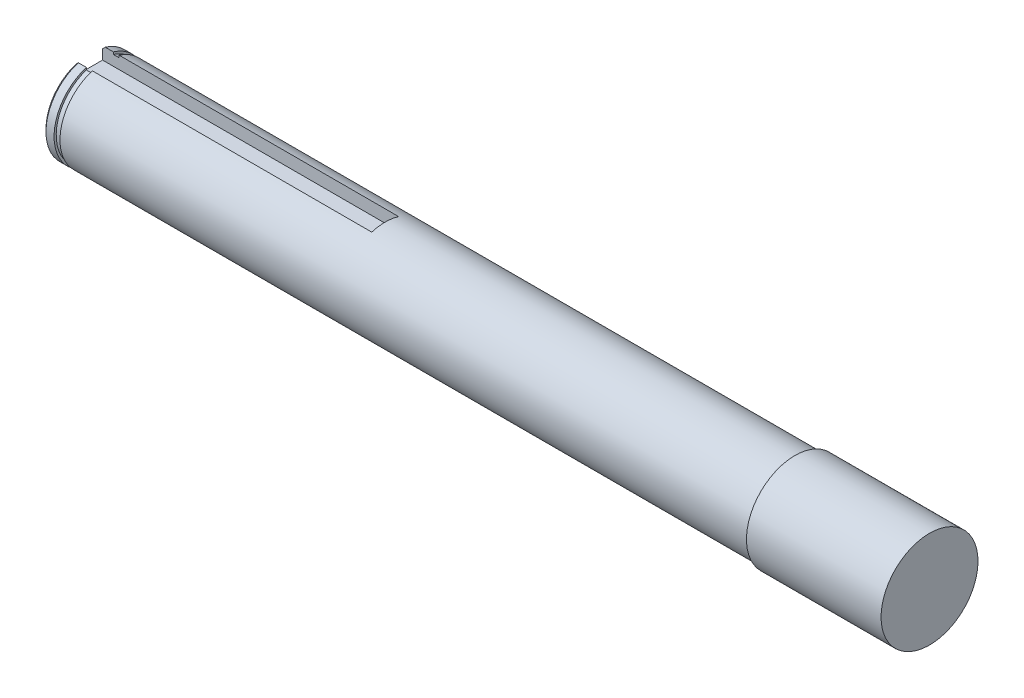
ISO-10303-21;
HEADER;
FILE_DESCRIPTION(('STEP AP214'),'2;1');
FILE_NAME('part.step','',(''),(''),'','','');
FILE_SCHEMA(('AUTOMOTIVE_DESIGN { 1 0 10303 214 1 1 1 1 }'));
ENDSEC;
DATA;
#1=APPLICATION_CONTEXT('core data for automotive mechanical design processes');
#2=APPLICATION_PROTOCOL_DEFINITION('international standard','automotive_design',2000,#1);
#3=PRODUCT_CONTEXT('',#1,'mechanical');
#4=PRODUCT('Part','Part','',(#3));
#5=PRODUCT_RELATED_PRODUCT_CATEGORY('part','',(#4));
#6=PRODUCT_DEFINITION_FORMATION('','',#4);
#7=PRODUCT_DEFINITION_CONTEXT('part definition',#1,'design');
#8=PRODUCT_DEFINITION('design','',#6,#7);
#9=PRODUCT_DEFINITION_SHAPE('','',#8);
#10=(LENGTH_UNIT() NAMED_UNIT(*) SI_UNIT(.MILLI.,.METRE.));
#11=(NAMED_UNIT(*) PLANE_ANGLE_UNIT() SI_UNIT($,.RADIAN.));
#12=(NAMED_UNIT(*) SI_UNIT($,.STERADIAN.) SOLID_ANGLE_UNIT());
#13=UNCERTAINTY_MEASURE_WITH_UNIT(LENGTH_MEASURE(1.E-05),#10,'distance_accuracy_value','');
#14=(GEOMETRIC_REPRESENTATION_CONTEXT(3) GLOBAL_UNCERTAINTY_ASSIGNED_CONTEXT((#13)) GLOBAL_UNIT_ASSIGNED_CONTEXT((#10,
#11,#12)) REPRESENTATION_CONTEXT('',''));
#15=CARTESIAN_POINT('',(0.,0.,0.));
#16=DIRECTION('',(0.,0.,1.));
#17=DIRECTION('',(1.,0.,0.));
#18=AXIS2_PLACEMENT_3D('',#15,#16,#17);
#19=CARTESIAN_POINT('',(0.,0.,0.));
#20=DIRECTION('',(1.,0.,0.));
#21=DIRECTION('',(0.,0.,1.));
#22=AXIS2_PLACEMENT_3D('',#19,#20,#21);
#23=PLANE('',#22);
#24=DIRECTION('',(0.,0.,-1.));
#25=VECTOR('',#24,1.);
#26=CARTESIAN_POINT('',(0.,5.8,2.5));
#27=LINE('',#26,#25);
#28=CARTESIAN_POINT('',(0.,5.8,2.5));
#29=VERTEX_POINT('',#28);
#30=CARTESIAN_POINT('',(0.,5.8,-2.5));
#31=VERTEX_POINT('',#30);
#32=EDGE_CURVE('E127',#29,#31,#27,.T.);
#33=ORIENTED_EDGE('',*,*,#32,.T.);
#34=DIRECTION('',(0.,1.,0.));
#35=VECTOR('',#34,1.);
#36=CARTESIAN_POINT('',(0.,5.8,-2.5));
#37=LINE('',#36,#35);
#38=CARTESIAN_POINT('',(0.,7.59934207678534,-2.5));
#39=VERTEX_POINT('',#38);
#40=EDGE_CURVE('E140',#31,#39,#37,.T.);
#41=ORIENTED_EDGE('',*,*,#40,.T.);
#42=CARTESIAN_POINT('',(0.,0.,0.));
#43=DIRECTION('',(-1.,0.,0.));
#44=DIRECTION('',(0.,0.,1.));
#45=AXIS2_PLACEMENT_3D('',#42,#43,#44);
#46=CIRCLE('',#45,8.);
#47=CARTESIAN_POINT('',(0.,7.59934207678534,2.5));
#48=VERTEX_POINT('',#47);
#49=EDGE_CURVE('E222',#48,#39,#46,.F.);
#50=ORIENTED_EDGE('',*,*,#49,.F.);
#51=DIRECTION('',(0.,-1.,0.));
#52=VECTOR('',#51,1.);
#53=CARTESIAN_POINT('',(0.,11.3,2.5));
#54=LINE('',#53,#52);
#55=EDGE_CURVE('E148',#48,#29,#54,.T.);
#56=ORIENTED_EDGE('',*,*,#55,.T.);
#57=EDGE_LOOP('',(#33,#41,#50,#56));
#58=FACE_BOUND('',#57,.T.);
#59=ADVANCED_FACE('F45',(#58),#23,.F.);
#60=CARTESIAN_POINT('',(0.,0.,0.));
#61=DIRECTION('',(-1.,0.,0.));
#62=DIRECTION('',(0.,0.,-1.));
#63=AXIS2_PLACEMENT_3D('',#60,#61,#62);
#64=CYLINDRICAL_SURFACE('',#63,8.5);
#65=CARTESIAN_POINT('',(0.5,0.,0.));
#66=DIRECTION('',(-1.,0.,0.));
#67=DIRECTION('',(0.,0.,1.));
#68=AXIS2_PLACEMENT_3D('',#65,#66,#67);
#69=CIRCLE('',#68,8.5);
#70=CARTESIAN_POINT('',(0.5,8.12403840463596,-2.5));
#71=VERTEX_POINT('',#70);
#72=CARTESIAN_POINT('',(0.5,8.12403840463596,2.5));
#73=VERTEX_POINT('',#72);
#74=EDGE_CURVE('E225',#71,#73,#69,.T.);
#75=ORIENTED_EDGE('',*,*,#74,.F.);
#76=DIRECTION('',(-1.,0.,0.));
#77=VECTOR('',#76,1.);
#78=CARTESIAN_POINT('',(0.,8.12403840463596,-2.5));
#79=LINE('',#78,#77);
#80=CARTESIAN_POINT('',(2.,8.12403840463596,-2.5));
#81=VERTEX_POINT('',#80);
#82=EDGE_CURVE('E157',#81,#71,#79,.T.);
#83=ORIENTED_EDGE('',*,*,#82,.F.);
#84=CARTESIAN_POINT('',(2.,0.,0.));
#85=DIRECTION('',(1.,0.,0.));
#86=DIRECTION('',(0.,0.,-1.));
#87=AXIS2_PLACEMENT_3D('',#84,#85,#86);
#88=CIRCLE('',#87,8.5);
#89=CARTESIAN_POINT('',(2.,8.12403840463596,2.5));
#90=VERTEX_POINT('',#89);
#91=EDGE_CURVE('E218',#90,#81,#88,.T.);
#92=ORIENTED_EDGE('',*,*,#91,.F.);
#93=DIRECTION('',(-1.,0.,0.));
#94=VECTOR('',#93,1.);
#95=CARTESIAN_POINT('',(0.,8.12403840463596,2.5));
#96=LINE('',#95,#94);
#97=EDGE_CURVE('E173',#73,#90,#96,.F.);
#98=ORIENTED_EDGE('',*,*,#97,.F.);
#99=EDGE_LOOP('',(#75,#83,#92,#98));
#100=FACE_BOUND('',#99,.T.);
#101=ADVANCED_FACE('F270',(#100),#64,.T.);
#102=CARTESIAN_POINT('',(2.,8.5,0.));
#103=DIRECTION('',(-1.,0.,0.));
#104=DIRECTION('',(0.,0.,-1.));
#105=AXIS2_PLACEMENT_3D('',#102,#103,#104);
#106=PLANE('',#105);
#107=ORIENTED_EDGE('',*,*,#91,.T.);
#108=DIRECTION('',(0.,1.,0.));
#109=VECTOR('',#108,1.);
#110=CARTESIAN_POINT('',(2.,8.5,-2.5));
#111=LINE('',#110,#109);
#112=CARTESIAN_POINT('',(2.,7.70454411370329,-2.5));
#113=VERTEX_POINT('',#112);
#114=EDGE_CURVE('E161',#113,#81,#111,.T.);
#115=ORIENTED_EDGE('',*,*,#114,.F.);
#116=CARTESIAN_POINT('',(2.,0.,0.));
#117=DIRECTION('',(1.,0.,0.));
#118=DIRECTION('',(0.,0.,-1.));
#119=AXIS2_PLACEMENT_3D('',#116,#117,#118);
#120=CIRCLE('',#119,8.1);
#121=CARTESIAN_POINT('',(2.,7.70454411370329,2.5));
#122=VERTEX_POINT('',#121);
#123=EDGE_CURVE('E214',#122,#113,#120,.T.);
#124=ORIENTED_EDGE('',*,*,#123,.F.);
#125=DIRECTION('',(0.,-1.,0.));
#126=VECTOR('',#125,1.);
#127=CARTESIAN_POINT('',(2.,8.5,2.5));
#128=LINE('',#127,#126);
#129=EDGE_CURVE('E177',#90,#122,#128,.T.);
#130=ORIENTED_EDGE('',*,*,#129,.F.);
#131=EDGE_LOOP('',(#107,#115,#124,#130));
#132=FACE_BOUND('',#131,.T.);
#133=ADVANCED_FACE('F266',(#132),#106,.F.);
#134=CARTESIAN_POINT('',(0.,0.,0.));
#135=DIRECTION('',(-1.,0.,0.));
#136=DIRECTION('',(0.,0.,-1.));
#137=AXIS2_PLACEMENT_3D('',#134,#135,#136);
#138=CYLINDRICAL_SURFACE('',#137,8.1);
#139=ORIENTED_EDGE('',*,*,#123,.T.);
#140=DIRECTION('',(-1.,0.,0.));
#141=VECTOR('',#140,1.);
#142=CARTESIAN_POINT('',(0.,7.70454411370329,-2.5));
#143=LINE('',#142,#141);
#144=CARTESIAN_POINT('',(3.1,7.70454411370329,-2.5));
#145=VERTEX_POINT('',#144);
#146=EDGE_CURVE('E164',#145,#113,#143,.T.);
#147=ORIENTED_EDGE('',*,*,#146,.F.);
#148=CARTESIAN_POINT('',(3.1,0.,0.));
#149=DIRECTION('',(1.,0.,0.));
#150=DIRECTION('',(0.,0.,-1.));
#151=AXIS2_PLACEMENT_3D('',#148,#149,#150);
#152=CIRCLE('',#151,8.1);
#153=CARTESIAN_POINT('',(3.1,7.70454411370329,2.5));
#154=VERTEX_POINT('',#153);
#155=EDGE_CURVE('E210',#154,#145,#152,.T.);
#156=ORIENTED_EDGE('',*,*,#155,.F.);
#157=DIRECTION('',(-1.,0.,0.));
#158=VECTOR('',#157,1.);
#159=CARTESIAN_POINT('',(0.,7.70454411370329,2.5));
#160=LINE('',#159,#158);
#161=EDGE_CURVE('E181',#122,#154,#160,.F.);
#162=ORIENTED_EDGE('',*,*,#161,.F.);
#163=EDGE_LOOP('',(#139,#147,#156,#162));
#164=FACE_BOUND('',#163,.T.);
#165=ADVANCED_FACE('F262',(#164),#138,.T.);
#166=CARTESIAN_POINT('',(3.1,8.1,0.));
#167=DIRECTION('',(1.,0.,0.));
#168=DIRECTION('',(0.,0.,1.));
#169=AXIS2_PLACEMENT_3D('',#166,#167,#168);
#170=PLANE('',#169);
#171=ORIENTED_EDGE('',*,*,#155,.T.);
#172=DIRECTION('',(0.,-1.,0.));
#173=VECTOR('',#172,1.);
#174=CARTESIAN_POINT('',(3.1,8.1,-2.5));
#175=LINE('',#174,#173);
#176=CARTESIAN_POINT('',(3.1,8.12403840463596,-2.5));
#177=VERTEX_POINT('',#176);
#178=EDGE_CURVE('E167',#177,#145,#175,.T.);
#179=ORIENTED_EDGE('',*,*,#178,.F.);
#180=CARTESIAN_POINT('',(3.1,0.,0.));
#181=DIRECTION('',(1.,0.,0.));
#182=DIRECTION('',(0.,0.,-1.));
#183=AXIS2_PLACEMENT_3D('',#180,#181,#182);
#184=CIRCLE('',#183,8.5);
#185=CARTESIAN_POINT('',(3.1,8.12403840463596,2.5));
#186=VERTEX_POINT('',#185);
#187=EDGE_CURVE('E207',#186,#177,#184,.T.);
#188=ORIENTED_EDGE('',*,*,#187,.F.);
#189=DIRECTION('',(0.,1.,0.));
#190=VECTOR('',#189,1.);
#191=CARTESIAN_POINT('',(3.1,8.1,2.5));
#192=LINE('',#191,#190);
#193=EDGE_CURVE('E185',#154,#186,#192,.T.);
#194=ORIENTED_EDGE('',*,*,#193,.F.);
#195=EDGE_LOOP('',(#171,#179,#188,#194));
#196=FACE_BOUND('',#195,.T.);
#197=ADVANCED_FACE('F259',(#196),#170,.F.);
#198=CARTESIAN_POINT('',(0.,0.,0.));
#199=DIRECTION('',(-1.,0.,0.));
#200=DIRECTION('',(0.,0.,-1.));
#201=AXIS2_PLACEMENT_3D('',#198,#199,#200);
#202=CYLINDRICAL_SURFACE('',#201,8.5);
#203=ORIENTED_EDGE('',*,*,#187,.T.);
#204=DIRECTION('',(-1.,0.,0.));
#205=VECTOR('',#204,1.);
#206=CARTESIAN_POINT('',(0.,8.12403840463596,-2.5));
#207=LINE('',#206,#205);
#208=CARTESIAN_POINT('',(55.,8.12403840463596,-2.5));
#209=VERTEX_POINT('',#208);
#210=EDGE_CURVE('E170',#209,#177,#207,.T.);
#211=ORIENTED_EDGE('',*,*,#210,.F.);
#212=CARTESIAN_POINT('',(55.,0.,0.));
#213=DIRECTION('',(1.,0.,0.));
#214=DIRECTION('',(0.,0.,-1.));
#215=AXIS2_PLACEMENT_3D('',#212,#213,#214);
#216=CIRCLE('',#215,8.5);
#217=CARTESIAN_POINT('',(55.,8.12403840463596,2.5));
#218=VERTEX_POINT('',#217);
#219=EDGE_CURVE('E11',#209,#218,#216,.T.);
#220=ORIENTED_EDGE('',*,*,#219,.T.);
#221=DIRECTION('',(-1.,0.,0.));
#222=VECTOR('',#221,1.);
#223=CARTESIAN_POINT('',(0.,8.12403840463596,2.5));
#224=LINE('',#223,#222);
#225=EDGE_CURVE('E69',#186,#218,#224,.F.);
#226=ORIENTED_EDGE('',*,*,#225,.F.);
#227=EDGE_LOOP('',(#203,#211,#220,#226));
#228=FACE_BOUND('',#227,.T.);
#229=CARTESIAN_POINT('',(131.1,0.,0.));
#230=DIRECTION('',(1.,0.,0.));
#231=DIRECTION('',(0.,0.,-1.));
#232=AXIS2_PLACEMENT_3D('',#229,#230,#231);
#233=CIRCLE('',#232,8.5);
#234=CARTESIAN_POINT('',(131.1,0.,-8.5));
#235=VERTEX_POINT('',#234);
#236=EDGE_CURVE('E203',#235,#235,#233,.T.);
#237=ORIENTED_EDGE('',*,*,#236,.F.);
#238=EDGE_LOOP('',(#237));
#239=FACE_BOUND('',#238,.T.);
#240=ADVANCED_FACE('F255',(#228,#239),#202,.T.);
#241=CARTESIAN_POINT('',(131.1,8.5,0.));
#242=DIRECTION('',(1.,0.,0.));
#243=DIRECTION('',(0.,0.,1.));
#244=AXIS2_PLACEMENT_3D('',#241,#242,#243);
#245=PLANE('',#244);
#246=ORIENTED_EDGE('',*,*,#236,.T.);
#247=EDGE_LOOP('',(#246));
#248=FACE_BOUND('',#247,.T.);
#249=CARTESIAN_POINT('',(131.1,0.,0.));
#250=DIRECTION('',(1.,0.,0.));
#251=DIRECTION('',(0.,0.,-1.));
#252=AXIS2_PLACEMENT_3D('',#249,#250,#251);
#253=CIRCLE('',#252,9.);
#254=CARTESIAN_POINT('',(131.1,0.,-9.));
#255=VERTEX_POINT('',#254);
#256=EDGE_CURVE('E199',#255,#255,#253,.T.);
#257=ORIENTED_EDGE('',*,*,#256,.F.);
#258=EDGE_LOOP('',(#257));
#259=FACE_BOUND('',#258,.T.);
#260=ADVANCED_FACE('F251',(#248,#259),#245,.F.);
#261=CARTESIAN_POINT('',(0.,0.,0.));
#262=DIRECTION('',(-1.,0.,0.));
#263=DIRECTION('',(0.,0.,-1.));
#264=AXIS2_PLACEMENT_3D('',#261,#262,#263);
#265=CYLINDRICAL_SURFACE('',#264,9.);
#266=CARTESIAN_POINT('',(143.1,-8.48528137423857,-3.));
#267=CARTESIAN_POINT('',(143.263404524508,-8.48528083591301,-3.00000077384314));
#268=CARTESIAN_POINT('',(143.426804399471,-8.49005307872571,-2.98660435105658));
#269=CARTESIAN_POINT('',(143.748763262983,-8.50852722243764,-2.93355339506643));
#270=CARTESIAN_POINT('',(143.907321449617,-8.52223059426567,-2.89389453650517));
#271=CARTESIAN_POINT('',(144.214880678992,-8.55684611066375,-2.78986645705471));
#272=CARTESIAN_POINT('',(144.363899788328,-8.57774411913965,-2.72554566420976));
#273=CARTESIAN_POINT('',(144.649080145644,-8.62437366030973,-2.57418488532417));
#274=CARTESIAN_POINT('',(144.785238547661,-8.65010625910836,-2.48713988658056));
#275=CARTESIAN_POINT('',(145.046159887015,-8.70463468222419,-2.28915343932864));
#276=CARTESIAN_POINT('',(145.170346286015,-8.73350684533931,-2.17747302413378));
#277=CARTESIAN_POINT('',(145.398620403674,-8.79041594403008,-1.9349630016432));
#278=CARTESIAN_POINT('',(145.502704894747,-8.81845274486885,-1.80413032515712));
#279=CARTESIAN_POINT('',(145.690436691989,-8.87141600765397,-1.52281352389504));
#280=CARTESIAN_POINT('',(145.773479911854,-8.89624223104816,-1.37190573367362));
#281=CARTESIAN_POINT('',(145.912774755383,-8.93908760312948,-1.05729366896247));
#282=CARTESIAN_POINT('',(145.969033599531,-8.95710858609005,-0.893592857061653));
#283=CARTESIAN_POINT('',(146.051207563897,-8.9837722629572,-0.564086452300485));
#284=CARTESIAN_POINT('',(146.078110338771,-8.99271944332677,-0.398552264558922));
#285=CARTESIAN_POINT('',(146.103948880082,-9.00130824654743,-0.0650936244722923));
#286=CARTESIAN_POINT('',(146.102891854957,-9.00095226788687,0.102830200631674));
#287=CARTESIAN_POINT('',(146.073467236302,-8.99118118856195,0.429310545581433));
#288=CARTESIAN_POINT('',(146.046172414577,-8.98212194265352,0.587976145774955));
#289=CARTESIAN_POINT('',(145.966821057059,-8.95640902019194,0.898330316466503));
#290=CARTESIAN_POINT('',(145.914762843061,-8.93975482893545,1.05001841333764));
#291=CARTESIAN_POINT('',(145.786736048082,-8.90027010879673,1.3444574245259));
#292=CARTESIAN_POINT('',(145.71046218436,-8.87736127572047,1.4870646629065));
#293=CARTESIAN_POINT('',(145.536420883654,-8.82775179116758,1.75777297658193));
#294=CARTESIAN_POINT('',(145.438647470017,-8.80105008604401,1.88587000315601));
#295=CARTESIAN_POINT('',(145.218976819621,-8.74518575549691,2.13030259965391));
#296=CARTESIAN_POINT('',(145.096160526476,-8.71596645506634,2.24580047119578));
#297=CARTESIAN_POINT('',(144.83265382282,-8.65942005746703,2.45483177879448));
#298=CARTESIAN_POINT('',(144.691960662816,-8.63209325236847,2.54836182984461));
#299=CARTESIAN_POINT('',(144.39403912319,-8.58211575363337,2.71196236510723));
#300=CARTESIAN_POINT('',(144.236603606047,-8.55953727854243,2.78167939086402));
#301=CARTESIAN_POINT('',(143.911285817357,-8.52244952473154,2.89332957980801));
#302=CARTESIAN_POINT('',(143.743407956381,-8.50793686461278,2.93527438724247));
#303=CARTESIAN_POINT('',(143.410084933765,-8.48938908946755,2.98848384629255));
#304=CARTESIAN_POINT('',(143.244871725754,-8.48491080956268,3.0010472865229));
#305=CARTESIAN_POINT('',(142.914671552658,-8.48570016177553,2.99881631672916));
#306=CARTESIAN_POINT('',(142.749684551928,-8.49096602375444,2.98402687568028));
#307=CARTESIAN_POINT('',(142.430529102864,-8.51020854270898,2.92867695465692));
#308=CARTESIAN_POINT('',(142.276183709548,-8.52387976322521,2.88901918194205));
#309=CARTESIAN_POINT('',(141.976369181282,-8.55805661013068,2.78614158768142));
#310=CARTESIAN_POINT('',(141.830901625228,-8.57856344804518,2.7229175890903));
#311=CARTESIAN_POINT('',(141.547858737459,-8.6249063278736,2.57242302221682));
#312=CARTESIAN_POINT('',(141.410680072075,-8.65089076996885,2.48445335507547));
#313=CARTESIAN_POINT('',(141.152561842849,-8.70497306192896,2.28775689167266));
#314=CARTESIAN_POINT('',(141.031627084016,-8.73307153331383,2.17902397649636));
#315=CARTESIAN_POINT('',(140.803416047728,-8.78985115913547,1.93767511770099));
#316=CARTESIAN_POINT('',(140.697076829943,-8.8184953073369,1.80416181163994));
#317=CARTESIAN_POINT('',(140.508251572956,-8.87180554839327,1.52048187420075));
#318=CARTESIAN_POINT('',(140.425764686513,-8.89647178253084,1.37031583459367));
#319=CARTESIAN_POINT('',(140.287739685415,-8.93893217431809,1.05833958729691));
#320=CARTESIAN_POINT('',(140.232026168556,-8.95677090013593,0.896613369963589));
#321=CARTESIAN_POINT('',(140.14881677382,-8.98375832513323,0.565375397538043));
#322=CARTESIAN_POINT('',(140.121310710358,-8.99291016102056,0.39586647586168));
#323=CARTESIAN_POINT('',(140.096213767183,-9.00125589708768,0.0624460075801456));
#324=CARTESIAN_POINT('',(140.097277638203,-9.00089760268317,-0.101354171760038));
#325=CARTESIAN_POINT('',(140.125971924439,-8.99136589558194,-0.426333435000508));
#326=CARTESIAN_POINT('',(140.153600184458,-8.98219319800727,-0.587512730457155));
#327=CARTESIAN_POINT('',(140.233746703728,-8.95622744863237,-0.900126358296175));
#328=CARTESIAN_POINT('',(140.285862646059,-8.93955775083445,-1.05167481273838));
#329=CARTESIAN_POINT('',(140.413132593292,-8.90031482113485,-1.34393505281939));
#330=CARTESIAN_POINT('',(140.488290765591,-8.8777405214405,-1.48464487242727));
#331=CARTESIAN_POINT('',(140.662708536306,-8.82797606483643,-1.75690204892633));
#332=CARTESIAN_POINT('',(140.762756056145,-8.80064617475779,-1.88791875467283));
#333=CARTESIAN_POINT('',(140.982772173469,-8.74478966375638,-2.1317430788173));
#334=CARTESIAN_POINT('',(141.102747126788,-8.71626266319292,-2.24454486487377));
#335=CARTESIAN_POINT('',(141.364828066761,-8.65989839476795,-2.45322542649934));
#336=CARTESIAN_POINT('',(141.50761653293,-8.63213183965892,-2.54826889799369));
#337=CARTESIAN_POINT('',(141.808003280708,-8.58180579969046,-2.71294302990334));
#338=CARTESIAN_POINT('',(141.965597679089,-8.55924495483748,-2.78258033045841));
#339=CARTESIAN_POINT('',(142.283885472047,-8.52304002619544,-2.89153148461249));
#340=CARTESIAN_POINT('',(142.444116790576,-8.50903898571547,-2.93207372744856));
#341=CARTESIAN_POINT('',(142.7695681514,-8.49016150618555,-2.9863029604478));
#342=CARTESIAN_POINT('',(142.934786452232,-8.48528191852383,-2.99999921758978));
#343=CARTESIAN_POINT('',(143.1,-8.48528137423857,-3.));
#344=B_SPLINE_CURVE_WITH_KNOTS('',3,(#266,#267,#268,#269,#270,#271,#272,#273,#274,#275,#276,
#277,#278,#279,#280,#281,#282,#283,#284,#285,#286,#287,#288,#289,#290,#291,#292,#293,#294,#295,
#296,#297,#298,#299,#300,#301,#302,#303,#304,#305,#306,#307,#308,#309,#310,#311,#312,#313,#314,
#315,#316,#317,#318,#319,#320,#321,#322,#323,#324,#325,#326,#327,#328,#329,#330,#331,#332,#333,
#334,#335,#336,#337,#338,#339,#340,#341,#342,#343),.UNSPECIFIED.,.T.,.F.,(4,2,2,2,2,2,2,2,2,2,2,
2,2,2,2,2,2,2,2,2,2,2,2,2,2,2,2,2,2,2,2,2,2,2,2,2,2,2,4),(0.,0.489601754398007,
0.979284165045345,1.46800988250241,1.95684349855632,2.46304012282701,2.96931795515958,
3.48880518430965,4.0081522916036,4.50942956294797,5.01057759906977,5.49207014476701,
5.97359532567702,6.46144964580997,6.94943975622058,7.46040523091744,7.97144938836311,
8.48977919529161,9.00789154069852,9.50262874093311,9.99727607511684,10.4749318730632,
10.9526723744084,11.4455657320715,11.9386045698638,12.4553642451328,12.972105562726,
13.4854137357255,13.9985364901247,14.4875425403291,14.9765089202934,15.4577086812129,
15.9389955228973,16.438065585619,16.9372951329789,17.4560670820843,17.974703348006,
18.4698963648807,18.9649184157139),.UNSPECIFIED.);
#345=CARTESIAN_POINT('',(143.1,-8.48528137423857,-3.));
#346=VERTEX_POINT('',#345);
#347=EDGE_CURVE('E194',#346,#346,#344,.T.);
#348=ORIENTED_EDGE('',*,*,#347,.F.);
#349=EDGE_LOOP('',(#348));
#350=FACE_BOUND('',#349,.T.);
#351=ORIENTED_EDGE('',*,*,#256,.T.);
#352=EDGE_LOOP('',(#351));
#353=FACE_BOUND('',#352,.T.);
#354=CARTESIAN_POINT('',(156.1,0.,0.));
#355=DIRECTION('',(1.,0.,0.));
#356=DIRECTION('',(0.,0.,-1.));
#357=AXIS2_PLACEMENT_3D('',#354,#355,#356);
#358=CIRCLE('',#357,9.);
#359=CARTESIAN_POINT('',(156.1,0.,-9.));
#360=VERTEX_POINT('',#359);
#361=EDGE_CURVE('E195',#360,#360,#358,.T.);
#362=ORIENTED_EDGE('',*,*,#361,.F.);
#363=EDGE_LOOP('',(#362));
#364=FACE_BOUND('',#363,.T.);
#365=ADVANCED_FACE('F246',(#350,#353,#364),#265,.T.);
#366=CARTESIAN_POINT('',(156.1,9.,0.));
#367=DIRECTION('',(-1.,0.,0.));
#368=DIRECTION('',(0.,0.,-1.));
#369=AXIS2_PLACEMENT_3D('',#366,#367,#368);
#370=PLANE('',#369);
#371=ORIENTED_EDGE('',*,*,#361,.T.);
#372=EDGE_LOOP('',(#371));
#373=FACE_BOUND('',#372,.T.);
#374=ADVANCED_FACE('F250',(#373),#370,.F.);
#375=CARTESIAN_POINT('',(0.,0.,0.));
#376=DIRECTION('',(1.,0.,0.));
#377=DIRECTION('',(0.,0.,1.));
#378=AXIS2_PLACEMENT_3D('',#375,#376,#377);
#379=CONICAL_SURFACE('',#378,8.,0.785398163397446);
#380=CARTESIAN_POINT('',(3.24610604354919,10.9647116306246,2.5));
#381=CARTESIAN_POINT('',(2.99226610631987,10.7043436729191,2.5));
#382=CARTESIAN_POINT('',(2.73864200216801,10.4437646712529,2.5));
#383=CARTESIAN_POINT('',(2.2319675749293,9.92205144385971,2.5));
#384=CARTESIAN_POINT('',(1.97891724967502,9.66091722023719,2.5));
#385=CARTESIAN_POINT('',(1.47356172830828,9.1379906840143,2.5));
#386=CARTESIAN_POINT('',(1.22125644417072,8.87619845652393,2.5));
#387=CARTESIAN_POINT('',(0.717566356513398,8.3517254890551,2.5));
#388=CARTESIAN_POINT('',(0.466181560123515,8.08904474222456,2.5));
#389=CARTESIAN_POINT('',(-0.0354029186888004,7.56248830616317,2.5));
#390=CARTESIAN_POINT('',(-0.285602442665667,7.29861246590988,2.5));
#391=CARTESIAN_POINT('',(-0.784347126830934,6.76930869771972,2.5));
#392=CARTESIAN_POINT('',(-1.0328923198316,6.50388080076392,2.5));
#393=CARTESIAN_POINT('',(-1.40397546236178,6.10409509913991,2.5));
#394=CARTESIAN_POINT('',(-1.52738902025476,5.97055013850755,2.5));
#395=CARTESIAN_POINT('',(-1.77350522053351,5.70280786524809,2.5));
#396=CARTESIAN_POINT('',(-1.89620786727091,5.56861055662342,2.5));
#397=CARTESIAN_POINT('',(-2.14075939416917,5.29942295024216,2.5));
#398=CARTESIAN_POINT('',(-2.26260821739897,5.16443260069008,2.5));
#399=CARTESIAN_POINT('',(-2.50522441386023,4.89347890214647,2.5));
#400=CARTESIAN_POINT('',(-2.62599176413088,4.75751553260641,2.5));
#401=CARTESIAN_POINT('',(-2.7461060435491,4.62097410787287,2.5));
#402=B_SPLINE_CURVE_WITH_KNOTS('',3,(#380,#381,#382,#383,#384,#385,#386,#387,#388,#389,#390,
#391,#392,#393,#394,#395,#396,#397,#398,#399,#400,#401),.UNSPECIFIED.,.F.,.F.,(4,2,2,2,2,2,2,2,
2,2,4),(0.,1.09088811407378,2.18177210044061,3.2725215843707,4.36327949919526,5.45417932798884,
6.54505745483649,7.0905702834248,7.63607976927667,8.18162528883418,8.72718236357148),.UNSPECIFIED.);
#403=EDGE_CURVE('E55',#73,#48,#402,.T.);
#404=ORIENTED_EDGE('',*,*,#403,.T.);
#405=ORIENTED_EDGE('',*,*,#49,.T.);
#406=CARTESIAN_POINT('',(-2.74610604354914,4.62097410787282,-2.5));
#407=CARTESIAN_POINT('',(-2.66135242444402,4.7173304968472,-2.5));
#408=CARTESIAN_POINT('',(-2.57626691146633,4.81339375304762,-2.5));
#409=CARTESIAN_POINT('',(-2.40552140151106,5.00500676740401,-2.5));
#410=CARTESIAN_POINT('',(-2.3198614103315,5.10055653072501,-2.5));
#411=CARTESIAN_POINT('',(-2.06215791358791,5.38654007082276,-2.5));
#412=CARTESIAN_POINT('',(-1.889384147226,5.57631573004792,-2.5));
#413=CARTESIAN_POINT('',(-1.54240055300874,5.95451406764861,-2.5));
#414=CARTESIAN_POINT('',(-1.36819086164736,6.14293687150735,-2.5));
#415=CARTESIAN_POINT('',(-1.01864950760585,6.51874212985348,-2.5));
#416=CARTESIAN_POINT('',(-0.843317831945389,6.70612457225783,-2.5));
#417=CARTESIAN_POINT('',(-0.316071063827654,7.26698950817808,-2.5));
#418=CARTESIAN_POINT('',(0.0371476941401721,7.63924588537825,-2.5));
#419=CARTESIAN_POINT('',(0.745830633262371,8.38162679915603,-2.5));
#420=CARTESIAN_POINT('',(1.1012948676923,8.75175128475163,-2.5));
#421=CARTESIAN_POINT('',(1.60612426497222,9.27519598982838,-2.5));
#422=CARTESIAN_POINT('',(1.75484886637541,9.42913459457362,-2.5));
#423=CARTESIAN_POINT('',(2.05253274789233,9.73678219574525,-2.5));
#424=CARTESIAN_POINT('',(2.20149202598042,9.89049119413146,-2.5));
#425=CARTESIAN_POINT('',(2.49962321546934,10.1977185877229,-2.5));
#426=CARTESIAN_POINT('',(2.64879513770283,10.3512369724139,-2.5));
#427=CARTESIAN_POINT('',(2.94732069775091,10.6580995039816,-2.5));
#428=CARTESIAN_POINT('',(3.09667433709522,10.8114436493703,-2.5));
#429=CARTESIAN_POINT('',(3.24610604354919,10.9647116306246,-2.5));
#430=B_SPLINE_CURVE_WITH_KNOTS('',3,(#406,#407,#408,#409,#410,#411,#412,#413,#414,#415,#416,
#417,#418,#419,#420,#421,#422,#423,#424,#425,#426,#427,#428,#429),.UNSPECIFIED.,.F.,.F.,(4,2,2,
2,2,2,2,2,2,2,2,4),(0.,0.384977817608326,0.769951755595784,1.53986909103482,2.30971406601729,
3.07956796356825,4.6190460584558,6.15856081679791,6.8007015083446,7.44283668718447,
8.08500583893924,8.72718043457028),.UNSPECIFIED.);
#431=EDGE_CURVE('E62',#39,#71,#430,.T.);
#432=ORIENTED_EDGE('',*,*,#431,.T.);
#433=ORIENTED_EDGE('',*,*,#74,.T.);
#434=EDGE_LOOP('',(#404,#405,#432,#433));
#435=FACE_BOUND('',#434,.T.);
#436=ADVANCED_FACE('F47',(#435),#379,.T.);
#437=CARTESIAN_POINT('',(143.1,-10.,0.));
#438=DIRECTION('',(0.,1.,0.));
#439=DIRECTION('',(0.,0.,-1.));
#440=AXIS2_PLACEMENT_3D('',#437,#438,#439);
#441=CYLINDRICAL_SURFACE('',#440,3.);
#442=CARTESIAN_POINT('',(143.1,-2.,0.));
#443=DIRECTION('',(0.,-1.,0.));
#444=DIRECTION('',(0.,0.,-1.));
#445=AXIS2_PLACEMENT_3D('',#442,#443,#444);
#446=CIRCLE('',#445,3.);
#447=CARTESIAN_POINT('',(143.1,-2.,-3.));
#448=VERTEX_POINT('',#447);
#449=EDGE_CURVE('E190',#448,#448,#446,.T.);
#450=ORIENTED_EDGE('',*,*,#449,.F.);
#451=EDGE_LOOP('',(#450));
#452=FACE_BOUND('',#451,.T.);
#453=ORIENTED_EDGE('',*,*,#347,.T.);
#454=EDGE_LOOP('',(#453));
#455=FACE_BOUND('',#454,.T.);
#456=ADVANCED_FACE('F242',(#452,#455),#441,.F.);
#457=CARTESIAN_POINT('',(143.1,-2.,0.));
#458=DIRECTION('',(0.,1.,0.));
#459=DIRECTION('',(0.,0.,-1.));
#460=AXIS2_PLACEMENT_3D('',#457,#458,#459);
#461=PLANE('',#460);
#462=ORIENTED_EDGE('',*,*,#449,.T.);
#463=EDGE_LOOP('',(#462));
#464=FACE_BOUND('',#463,.T.);
#465=ADVANCED_FACE('F309',(#464),#461,.F.);
#466=CARTESIAN_POINT('',(55.,0.,0.));
#467=DIRECTION('',(-1.,0.,0.));
#468=DIRECTION('',(0.,0.,-1.));
#469=AXIS2_PLACEMENT_3D('',#466,#467,#468);
#470=PLANE('',#469);
#471=ORIENTED_EDGE('',*,*,#219,.F.);
#472=DIRECTION('',(0.,1.,0.));
#473=VECTOR('',#472,1.);
#474=CARTESIAN_POINT('',(55.,5.8,-2.5));
#475=LINE('',#474,#473);
#476=CARTESIAN_POINT('',(55.,5.8,-2.5));
#477=VERTEX_POINT('',#476);
#478=EDGE_CURVE('E133',#477,#209,#475,.T.);
#479=ORIENTED_EDGE('',*,*,#478,.F.);
#480=DIRECTION('',(0.,0.,-1.));
#481=VECTOR('',#480,1.);
#482=CARTESIAN_POINT('',(55.,5.8,2.5));
#483=LINE('',#482,#481);
#484=CARTESIAN_POINT('',(55.,5.8,2.5));
#485=VERTEX_POINT('',#484);
#486=EDGE_CURVE('E124',#485,#477,#483,.T.);
#487=ORIENTED_EDGE('',*,*,#486,.F.);
#488=DIRECTION('',(0.,-1.,0.));
#489=VECTOR('',#488,1.);
#490=CARTESIAN_POINT('',(55.,11.3,2.5));
#491=LINE('',#490,#489);
#492=EDGE_CURVE('E135',#218,#485,#491,.T.);
#493=ORIENTED_EDGE('',*,*,#492,.F.);
#494=EDGE_LOOP('',(#471,#479,#487,#493));
#495=FACE_BOUND('',#494,.T.);
#496=ADVANCED_FACE('F142',(#495),#470,.T.);
#497=CARTESIAN_POINT('',(55.,11.3,2.5));
#498=DIRECTION('',(0.,0.,1.));
#499=DIRECTION('',(0.,1.,0.));
#500=AXIS2_PLACEMENT_3D('',#497,#498,#499);
#501=PLANE('',#500);
#502=ORIENTED_EDGE('',*,*,#193,.T.);
#503=ORIENTED_EDGE('',*,*,#225,.T.);
#504=ORIENTED_EDGE('',*,*,#492,.T.);
#505=DIRECTION('',(-1.,0.,0.));
#506=VECTOR('',#505,1.);
#507=CARTESIAN_POINT('',(55.,5.8,2.5));
#508=LINE('',#507,#506);
#509=EDGE_CURVE('E120',#485,#29,#508,.T.);
#510=ORIENTED_EDGE('',*,*,#509,.T.);
#511=ORIENTED_EDGE('',*,*,#55,.F.);
#512=ORIENTED_EDGE('',*,*,#403,.F.);
#513=ORIENTED_EDGE('',*,*,#97,.T.);
#514=ORIENTED_EDGE('',*,*,#129,.T.);
#515=ORIENTED_EDGE('',*,*,#161,.T.);
#516=EDGE_LOOP('',(#502,#503,#504,#510,#511,#512,#513,#514,#515));
#517=FACE_BOUND('',#516,.T.);
#518=ADVANCED_FACE('F136',(#517),#501,.F.);
#519=CARTESIAN_POINT('',(55.,5.8,-2.5));
#520=DIRECTION('',(0.,0.,-1.));
#521=DIRECTION('',(0.,-1.,0.));
#522=AXIS2_PLACEMENT_3D('',#519,#520,#521);
#523=PLANE('',#522);
#524=ORIENTED_EDGE('',*,*,#478,.T.);
#525=ORIENTED_EDGE('',*,*,#210,.T.);
#526=ORIENTED_EDGE('',*,*,#178,.T.);
#527=ORIENTED_EDGE('',*,*,#146,.T.);
#528=ORIENTED_EDGE('',*,*,#114,.T.);
#529=ORIENTED_EDGE('',*,*,#82,.T.);
#530=ORIENTED_EDGE('',*,*,#431,.F.);
#531=ORIENTED_EDGE('',*,*,#40,.F.);
#532=DIRECTION('',(-1.,0.,0.));
#533=VECTOR('',#532,1.);
#534=CARTESIAN_POINT('',(55.,5.8,-2.5));
#535=LINE('',#534,#533);
#536=EDGE_CURVE('E132',#477,#31,#535,.T.);
#537=ORIENTED_EDGE('',*,*,#536,.F.);
#538=EDGE_LOOP('',(#524,#525,#526,#527,#528,#529,#530,#531,#537));
#539=FACE_BOUND('',#538,.T.);
#540=ADVANCED_FACE('F286',(#539),#523,.F.);
#541=CARTESIAN_POINT('',(55.,5.8,2.5));
#542=DIRECTION('',(0.,-1.,0.));
#543=DIRECTION('',(0.,0.,1.));
#544=AXIS2_PLACEMENT_3D('',#541,#542,#543);
#545=PLANE('',#544);
#546=ORIENTED_EDGE('',*,*,#32,.F.);
#547=ORIENTED_EDGE('',*,*,#509,.F.);
#548=ORIENTED_EDGE('',*,*,#486,.T.);
#549=ORIENTED_EDGE('',*,*,#536,.T.);
#550=EDGE_LOOP('',(#546,#547,#548,#549));
#551=FACE_BOUND('',#550,.T.);
#552=ADVANCED_FACE('F122',(#551),#545,.F.);
#553=CLOSED_SHELL('',(#59,#101,#133,#165,#197,#240,#260,#365,#374,#436,#456,#465,#496,#518,#540,#552));
#554=MANIFOLD_SOLID_BREP('B2',#553);
#555=ADVANCED_BREP_SHAPE_REPRESENTATION('',(#18,#554),#14);
#556=SHAPE_DEFINITION_REPRESENTATION(#9,#555);
ENDSEC;
END-ISO-10303-21;
